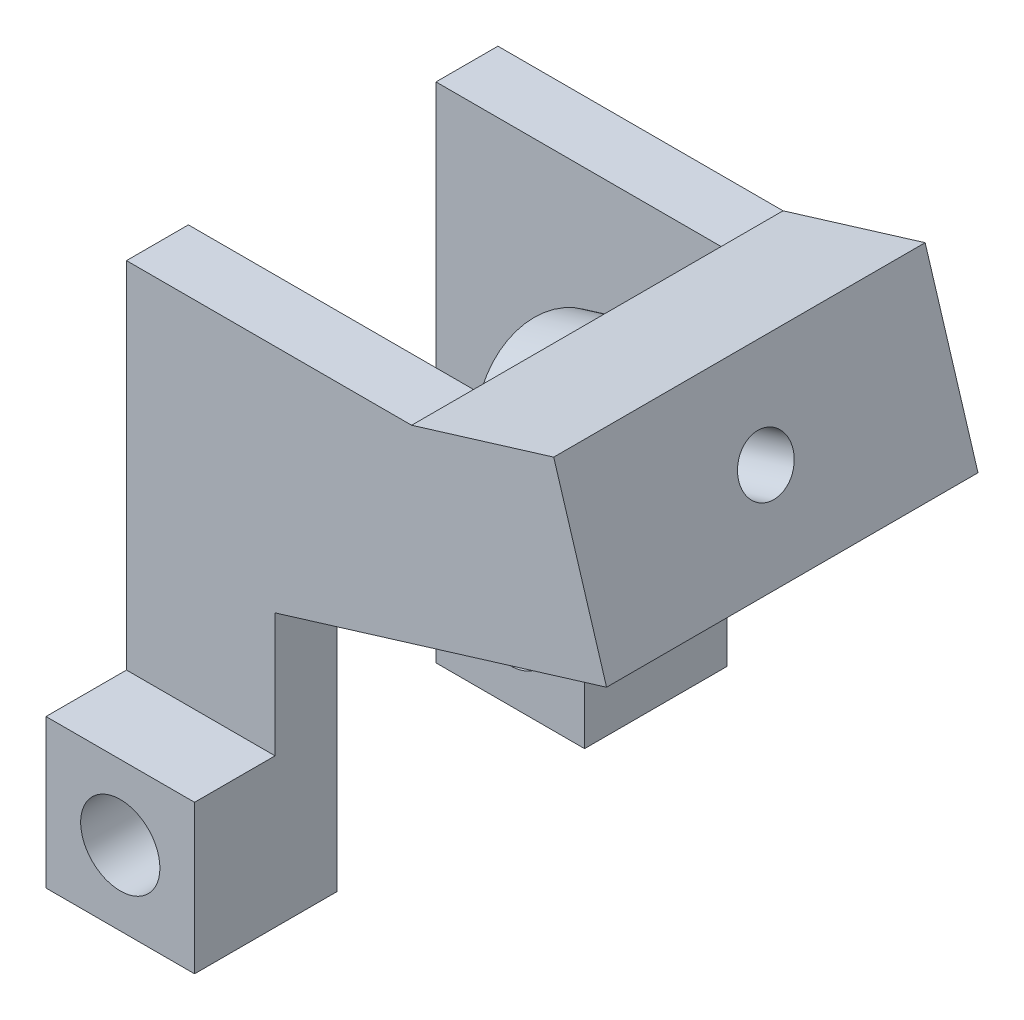
ISO-10303-21;
HEADER;
FILE_DESCRIPTION(('STEP AP214'),'2;1');
FILE_NAME('part.step','',(''),(''),'','','');
FILE_SCHEMA(('AUTOMOTIVE_DESIGN { 1 0 10303 214 1 1 1 1 }'));
ENDSEC;
DATA;
#1=APPLICATION_CONTEXT('core data for automotive mechanical design processes');
#2=APPLICATION_PROTOCOL_DEFINITION('international standard','automotive_design',2000,#1);
#3=PRODUCT_CONTEXT('',#1,'mechanical');
#4=PRODUCT('Part','Part','',(#3));
#5=PRODUCT_RELATED_PRODUCT_CATEGORY('part','',(#4));
#6=PRODUCT_DEFINITION_FORMATION('','',#4);
#7=PRODUCT_DEFINITION_CONTEXT('part definition',#1,'design');
#8=PRODUCT_DEFINITION('design','',#6,#7);
#9=PRODUCT_DEFINITION_SHAPE('','',#8);
#10=(LENGTH_UNIT() NAMED_UNIT(*) SI_UNIT(.MILLI.,.METRE.));
#11=(NAMED_UNIT(*) PLANE_ANGLE_UNIT() SI_UNIT($,.RADIAN.));
#12=(NAMED_UNIT(*) SI_UNIT($,.STERADIAN.) SOLID_ANGLE_UNIT());
#13=UNCERTAINTY_MEASURE_WITH_UNIT(LENGTH_MEASURE(1.E-05),#10,'distance_accuracy_value','');
#14=(GEOMETRIC_REPRESENTATION_CONTEXT(3) GLOBAL_UNCERTAINTY_ASSIGNED_CONTEXT((#13)) GLOBAL_UNIT_ASSIGNED_CONTEXT((#10,
#11,#12)) REPRESENTATION_CONTEXT('',''));
#15=CARTESIAN_POINT('',(0.,0.,0.));
#16=DIRECTION('',(0.,0.,1.));
#17=DIRECTION('',(1.,0.,0.));
#18=AXIS2_PLACEMENT_3D('',#15,#16,#17);
#19=CARTESIAN_POINT('',(0.,0.,9.525));
#20=DIRECTION('',(0.,0.,1.));
#21=DIRECTION('',(1.,0.,0.));
#22=AXIS2_PLACEMENT_3D('',#19,#20,#21);
#23=PLANE('',#22);
#24=DIRECTION('',(0.,-1.,0.));
#25=VECTOR('',#24,1.);
#26=CARTESIAN_POINT('',(-3.51366666666666,18.1652312458496,9.525));
#27=LINE('',#26,#25);
#28=CARTESIAN_POINT('',(-3.51366666666666,18.1652312458496,9.525));
#29=VERTEX_POINT('',#28);
#30=CARTESIAN_POINT('',(-3.51366666666666,-0.0211666666666693,9.525));
#31=VERTEX_POINT('',#30);
#32=EDGE_CURVE('E343',#29,#31,#27,.T.);
#33=ORIENTED_EDGE('',*,*,#32,.T.);
#34=DIRECTION('',(1.,0.,0.));
#35=VECTOR('',#34,1.);
#36=CARTESIAN_POINT('',(-12.1797301472788,-0.0211666666666693,9.525));
#37=LINE('',#36,#35);
#38=CARTESIAN_POINT('',(4.10633333333333,-0.0211666666666693,9.525));
#39=VERTEX_POINT('',#38);
#40=EDGE_CURVE('E236',#31,#39,#37,.T.);
#41=ORIENTED_EDGE('',*,*,#40,.T.);
#42=DIRECTION('',(0.,1.,0.));
#43=VECTOR('',#42,1.);
#44=CARTESIAN_POINT('',(4.10633333333333,-7.64116666666667,9.525));
#45=LINE('',#44,#43);
#46=CARTESIAN_POINT('',(4.10633333333333,6.32883333333333,9.525));
#47=VERTEX_POINT('',#46);
#48=EDGE_CURVE('E340',#39,#47,#45,.T.);
#49=ORIENTED_EDGE('',*,*,#48,.T.);
#50=DIRECTION('',(0.956304755963035,0.292371704722738,0.));
#51=VECTOR('',#50,1.);
#52=CARTESIAN_POINT('',(4.10633333333333,6.32883333333333,9.525));
#53=LINE('',#52,#51);
#54=CARTESIAN_POINT('',(21.1094318943561,11.5272022433036,9.525));
#55=VERTEX_POINT('',#54);
#56=EDGE_CURVE('E337',#47,#55,#53,.T.);
#57=ORIENTED_EDGE('',*,*,#56,.T.);
#58=DIRECTION('',(0.292371704722738,-0.956304755963035,0.));
#59=VECTOR('',#58,1.);
#60=CARTESIAN_POINT('',(22.5279368806983,6.8874814943936,9.525));
#61=LINE('',#60,#59);
#62=CARTESIAN_POINT('',(18.3988538198716,20.3931036358369,9.525));
#63=VERTEX_POINT('',#62);
#64=EDGE_CURVE('E301',#63,#55,#61,.T.);
#65=ORIENTED_EDGE('',*,*,#64,.F.);
#66=DIRECTION('',(-0.956304755963035,-0.292371704722738,0.));
#67=VECTOR('',#66,1.);
#68=CARTESIAN_POINT('',(18.3988538198716,20.3931036358369,9.525));
#69=LINE('',#68,#67);
#70=CARTESIAN_POINT('',(11.1118115794333,18.1652312458496,9.525));
#71=VERTEX_POINT('',#70);
#72=EDGE_CURVE('E316',#63,#71,#69,.T.);
#73=ORIENTED_EDGE('',*,*,#72,.T.);
#74=DIRECTION('',(-1.,0.,0.));
#75=VECTOR('',#74,1.);
#76=CARTESIAN_POINT('',(11.1118115794333,18.1652312458496,9.525));
#77=LINE('',#76,#75);
#78=EDGE_CURVE('E55',#71,#29,#77,.T.);
#79=ORIENTED_EDGE('',*,*,#78,.T.);
#80=EDGE_LOOP('',(#33,#41,#49,#57,#65,#73,#79));
#81=FACE_BOUND('',#80,.T.);
#82=ADVANCED_FACE('F45',(#81),#23,.T.);
#83=CARTESIAN_POINT('',(15.2408946402599,4.65960910440634,0.));
#84=DIRECTION('',(0.956304755963035,0.292371704722738,0.));
#85=DIRECTION('',(-0.292371704722738,0.956304755963035,0.));
#86=AXIS2_PLACEMENT_3D('',#83,#84,#85);
#87=PLANE('',#86);
#88=CARTESIAN_POINT('',(12.4671006166755,13.732280549583,0.));
#89=DIRECTION('',(0.956304755963035,0.292371704722738,0.));
#90=DIRECTION('',(-0.292371704722738,0.956304755963035,0.));
#91=AXIS2_PLACEMENT_3D('',#88,#89,#90);
#92=CIRCLE('',#91,4.064);
#93=CARTESIAN_POINT('',(11.2789020086823,17.6187030778168,0.));
#94=VERTEX_POINT('',#93);
#95=EDGE_CURVE('E227',#94,#94,#92,.T.);
#96=ORIENTED_EDGE('',*,*,#95,.T.);
#97=EDGE_LOOP('',(#96));
#98=FACE_BOUND('',#97,.T.);
#99=DIRECTION('',(0.292371704722738,-0.956304755963035,0.));
#100=VECTOR('',#99,1.);
#101=CARTESIAN_POINT('',(13.8223896539178,9.29932985331635,-6.35));
#102=LINE('',#101,#100);
#103=CARTESIAN_POINT('',(11.1118115794333,18.1652312458496,-6.34999999999999));
#104=VERTEX_POINT('',#103);
#105=CARTESIAN_POINT('',(13.8223896539178,9.29932985331635,-6.35));
#106=VERTEX_POINT('',#105);
#107=EDGE_CURVE('E261',#104,#106,#102,.T.);
#108=ORIENTED_EDGE('',*,*,#107,.T.);
#109=DIRECTION('',(0.,0.,-1.));
#110=VECTOR('',#109,1.);
#111=CARTESIAN_POINT('',(13.8223896539178,9.29932985331635,0.));
#112=LINE('',#111,#110);
#113=CARTESIAN_POINT('',(13.8223896539178,9.29932985331635,6.35));
#114=VERTEX_POINT('',#113);
#115=EDGE_CURVE('E296',#114,#106,#112,.T.);
#116=ORIENTED_EDGE('',*,*,#115,.F.);
#117=DIRECTION('',(-0.292371704722738,0.956304755963035,0.));
#118=VECTOR('',#117,1.);
#119=CARTESIAN_POINT('',(13.8223896539178,9.29932985331635,6.35));
#120=LINE('',#119,#118);
#121=CARTESIAN_POINT('',(11.1118115794333,18.1652312458496,6.35));
#122=VERTEX_POINT('',#121);
#123=EDGE_CURVE('E358',#114,#122,#120,.T.);
#124=ORIENTED_EDGE('',*,*,#123,.T.);
#125=DIRECTION('',(0.,0.,1.));
#126=VECTOR('',#125,1.);
#127=CARTESIAN_POINT('',(11.1118115794333,18.1652312458496,0.));
#128=LINE('',#127,#126);
#129=EDGE_CURVE('E320',#104,#122,#128,.T.);
#130=ORIENTED_EDGE('',*,*,#129,.F.);
#131=EDGE_LOOP('',(#108,#116,#124,#130));
#132=FACE_BOUND('',#131,.T.);
#133=ADVANCED_FACE('F394',(#98,#132),#87,.F.);
#134=CARTESIAN_POINT('',(-3.51366666666666,18.1652312458496,9.525));
#135=DIRECTION('',(1.,0.,0.));
#136=DIRECTION('',(0.,0.,-1.));
#137=AXIS2_PLACEMENT_3D('',#134,#135,#136);
#138=PLANE('',#137);
#139=DIRECTION('',(0.,0.,-1.));
#140=VECTOR('',#139,1.);
#141=CARTESIAN_POINT('',(-3.51366666666666,18.1652312458496,9.525));
#142=LINE('',#141,#140);
#143=CARTESIAN_POINT('',(-3.51366666666666,18.1652312458496,6.35));
#144=VERTEX_POINT('',#143);
#145=EDGE_CURVE('E49',#29,#144,#142,.T.);
#146=ORIENTED_EDGE('',*,*,#145,.T.);
#147=DIRECTION('',(0.,-1.,0.));
#148=VECTOR('',#147,1.);
#149=CARTESIAN_POINT('',(-3.51366666666666,18.1652312458496,6.35));
#150=LINE('',#149,#148);
#151=CARTESIAN_POINT('',(-3.51366666666666,-7.64116666666667,6.35));
#152=VERTEX_POINT('',#151);
#153=EDGE_CURVE('E367',#144,#152,#150,.T.);
#154=ORIENTED_EDGE('',*,*,#153,.T.);
#155=DIRECTION('',(0.,0.,-1.));
#156=VECTOR('',#155,1.);
#157=CARTESIAN_POINT('',(-3.51366666666666,-7.64116666666667,9.525));
#158=LINE('',#157,#156);
#159=CARTESIAN_POINT('',(-3.51366666666666,-7.64116666666667,13.6525));
#160=VERTEX_POINT('',#159);
#161=EDGE_CURVE('E365',#160,#152,#158,.T.);
#162=ORIENTED_EDGE('',*,*,#161,.F.);
#163=DIRECTION('',(0.,1.,0.));
#164=VECTOR('',#163,1.);
#165=CARTESIAN_POINT('',(-3.51366666666666,-0.0211666666666693,13.6525));
#166=LINE('',#165,#164);
#167=CARTESIAN_POINT('',(-3.51366666666666,-0.0211666666666693,13.6525));
#168=VERTEX_POINT('',#167);
#169=EDGE_CURVE('E223',#160,#168,#166,.T.);
#170=ORIENTED_EDGE('',*,*,#169,.T.);
#171=DIRECTION('',(0.,0.,-1.));
#172=VECTOR('',#171,1.);
#173=CARTESIAN_POINT('',(-3.51366666666666,-0.0211666666666693,13.6525));
#174=LINE('',#173,#172);
#175=EDGE_CURVE('E220',#168,#31,#174,.T.);
#176=ORIENTED_EDGE('',*,*,#175,.T.);
#177=ORIENTED_EDGE('',*,*,#32,.F.);
#178=EDGE_LOOP('',(#146,#154,#162,#170,#176,#177));
#179=FACE_BOUND('',#178,.T.);
#180=ADVANCED_FACE('F47',(#179),#138,.F.);
#181=CARTESIAN_POINT('',(-3.51366666666666,-7.64116666666667,9.525));
#182=DIRECTION('',(0.,1.,0.));
#183=DIRECTION('',(0.,0.,1.));
#184=AXIS2_PLACEMENT_3D('',#181,#182,#183);
#185=PLANE('',#184);
#186=ORIENTED_EDGE('',*,*,#161,.T.);
#187=DIRECTION('',(1.,0.,0.));
#188=VECTOR('',#187,1.);
#189=CARTESIAN_POINT('',(-3.51366666666666,-7.64116666666667,6.35));
#190=LINE('',#189,#188);
#191=CARTESIAN_POINT('',(4.10633333333333,-7.64116666666667,6.35));
#192=VERTEX_POINT('',#191);
#193=EDGE_CURVE('E362',#152,#192,#190,.T.);
#194=ORIENTED_EDGE('',*,*,#193,.T.);
#195=DIRECTION('',(0.,0.,-1.));
#196=VECTOR('',#195,1.);
#197=CARTESIAN_POINT('',(4.10633333333333,-7.64116666666667,9.525));
#198=LINE('',#197,#196);
#199=CARTESIAN_POINT('',(4.10633333333333,-7.64116666666667,13.6525));
#200=VERTEX_POINT('',#199);
#201=EDGE_CURVE('E353',#200,#192,#198,.T.);
#202=ORIENTED_EDGE('',*,*,#201,.F.);
#203=DIRECTION('',(1.,0.,0.));
#204=VECTOR('',#203,1.);
#205=CARTESIAN_POINT('',(-12.1797301472788,-7.64116666666667,13.6525));
#206=LINE('',#205,#204);
#207=EDGE_CURVE('E233',#160,#200,#206,.T.);
#208=ORIENTED_EDGE('',*,*,#207,.F.);
#209=EDGE_LOOP('',(#186,#194,#202,#208));
#210=FACE_BOUND('',#209,.T.);
#211=ADVANCED_FACE('F406',(#210),#185,.F.);
#212=CARTESIAN_POINT('',(4.10633333333333,-7.64116666666667,9.525));
#213=DIRECTION('',(-1.,0.,0.));
#214=DIRECTION('',(0.,0.,1.));
#215=AXIS2_PLACEMENT_3D('',#212,#213,#214);
#216=PLANE('',#215);
#217=ORIENTED_EDGE('',*,*,#201,.T.);
#218=DIRECTION('',(0.,1.,0.));
#219=VECTOR('',#218,1.);
#220=CARTESIAN_POINT('',(4.10633333333333,-7.64116666666667,6.35));
#221=LINE('',#220,#219);
#222=CARTESIAN_POINT('',(4.10633333333333,6.32883333333333,6.35));
#223=VERTEX_POINT('',#222);
#224=EDGE_CURVE('E348',#192,#223,#221,.T.);
#225=ORIENTED_EDGE('',*,*,#224,.T.);
#226=DIRECTION('',(0.,0.,-1.));
#227=VECTOR('',#226,1.);
#228=CARTESIAN_POINT('',(4.10633333333333,6.32883333333333,9.525));
#229=LINE('',#228,#227);
#230=EDGE_CURVE('E352',#47,#223,#229,.T.);
#231=ORIENTED_EDGE('',*,*,#230,.F.);
#232=ORIENTED_EDGE('',*,*,#48,.F.);
#233=DIRECTION('',(0.,0.,1.));
#234=VECTOR('',#233,1.);
#235=CARTESIAN_POINT('',(4.10633333333333,-0.0211666666666693,13.6525));
#236=LINE('',#235,#234);
#237=CARTESIAN_POINT('',(4.10633333333333,-0.0211666666666693,13.6525));
#238=VERTEX_POINT('',#237);
#239=EDGE_CURVE('E71',#39,#238,#236,.T.);
#240=ORIENTED_EDGE('',*,*,#239,.T.);
#241=DIRECTION('',(0.,-1.,0.));
#242=VECTOR('',#241,1.);
#243=CARTESIAN_POINT('',(4.10633333333333,-0.0211666666666693,13.6525));
#244=LINE('',#243,#242);
#245=EDGE_CURVE('E219',#238,#200,#244,.T.);
#246=ORIENTED_EDGE('',*,*,#245,.T.);
#247=EDGE_LOOP('',(#217,#225,#231,#232,#240,#246));
#248=FACE_BOUND('',#247,.T.);
#249=ADVANCED_FACE('F401',(#248),#216,.F.);
#250=CARTESIAN_POINT('',(4.10633333333333,6.32883333333333,9.525));
#251=DIRECTION('',(-0.292371704722738,0.956304755963035,0.));
#252=DIRECTION('',(-0.956304755963035,-0.292371704722738,0.));
#253=AXIS2_PLACEMENT_3D('',#250,#251,#252);
#254=PLANE('',#253);
#255=ORIENTED_EDGE('',*,*,#230,.T.);
#256=DIRECTION('',(0.956304755963035,0.292371704722738,0.));
#257=VECTOR('',#256,1.);
#258=CARTESIAN_POINT('',(4.10633333333333,6.32883333333333,6.35));
#259=LINE('',#258,#257);
#260=EDGE_CURVE('E354',#223,#114,#259,.T.);
#261=ORIENTED_EDGE('',*,*,#260,.T.);
#262=ORIENTED_EDGE('',*,*,#115,.T.);
#263=DIRECTION('',(-0.956304755963035,-0.292371704722738,0.));
#264=VECTOR('',#263,1.);
#265=CARTESIAN_POINT('',(4.10633333333334,6.32883333333333,-6.35));
#266=LINE('',#265,#264);
#267=CARTESIAN_POINT('',(4.10633333333333,6.32883333333333,-6.35));
#268=VERTEX_POINT('',#267);
#269=EDGE_CURVE('E267',#106,#268,#266,.T.);
#270=ORIENTED_EDGE('',*,*,#269,.T.);
#271=DIRECTION('',(0.,0.,-1.));
#272=VECTOR('',#271,1.);
#273=CARTESIAN_POINT('',(4.10633333333333,6.32883333333333,9.525));
#274=LINE('',#273,#272);
#275=CARTESIAN_POINT('',(4.10633333333333,6.32883333333333,-9.525));
#276=VERTEX_POINT('',#275);
#277=EDGE_CURVE('E287',#268,#276,#274,.T.);
#278=ORIENTED_EDGE('',*,*,#277,.T.);
#279=DIRECTION('',(-0.956304755963035,-0.292371704722738,0.));
#280=VECTOR('',#279,1.);
#281=CARTESIAN_POINT('',(21.1094318943561,11.5272022433036,-9.525));
#282=LINE('',#281,#280);
#283=CARTESIAN_POINT('',(21.1094318943561,11.5272022433036,-9.525));
#284=VERTEX_POINT('',#283);
#285=EDGE_CURVE('E331',#284,#276,#282,.T.);
#286=ORIENTED_EDGE('',*,*,#285,.F.);
#287=DIRECTION('',(0.,0.,-1.));
#288=VECTOR('',#287,1.);
#289=CARTESIAN_POINT('',(21.1094318943561,11.5272022433036,0.));
#290=LINE('',#289,#288);
#291=EDGE_CURVE('E306',#55,#284,#290,.T.);
#292=ORIENTED_EDGE('',*,*,#291,.F.);
#293=ORIENTED_EDGE('',*,*,#56,.F.);
#294=EDGE_LOOP('',(#255,#261,#262,#270,#278,#286,#292,#293));
#295=FACE_BOUND('',#294,.T.);
#296=ADVANCED_FACE('F397',(#295),#254,.F.);
#297=CARTESIAN_POINT('',(11.1118115794333,18.1652312458496,9.525));
#298=DIRECTION('',(0.,-1.,0.));
#299=DIRECTION('',(0.,0.,-1.));
#300=AXIS2_PLACEMENT_3D('',#297,#298,#299);
#301=PLANE('',#300);
#302=DIRECTION('',(0.,0.,-1.));
#303=VECTOR('',#302,1.);
#304=CARTESIAN_POINT('',(11.1118115794333,18.1652312458496,9.525));
#305=LINE('',#304,#303);
#306=EDGE_CURVE('E347',#71,#122,#305,.T.);
#307=ORIENTED_EDGE('',*,*,#306,.T.);
#308=DIRECTION('',(1.,0.,0.));
#309=VECTOR('',#308,1.);
#310=CARTESIAN_POINT('',(-3.51366666666666,18.1652312458496,6.35));
#311=LINE('',#310,#309);
#312=EDGE_CURVE('E11',#144,#122,#311,.T.);
#313=ORIENTED_EDGE('',*,*,#312,.F.);
#314=ORIENTED_EDGE('',*,*,#145,.F.);
#315=ORIENTED_EDGE('',*,*,#78,.F.);
#316=EDGE_LOOP('',(#307,#313,#314,#315));
#317=FACE_BOUND('',#316,.T.);
#318=ADVANCED_FACE('F384',(#317),#301,.F.);
#319=CARTESIAN_POINT('',(-3.51366666666666,18.1652312458496,6.35));
#320=DIRECTION('',(0.,0.,1.));
#321=DIRECTION('',(0.,-1.,0.));
#322=AXIS2_PLACEMENT_3D('',#319,#320,#321);
#323=PLANE('',#322);
#324=CARTESIAN_POINT('',(0.296333333333336,-3.83116666666667,6.35));
#325=DIRECTION('',(0.,0.,1.));
#326=DIRECTION('',(0.,-1.,0.));
#327=AXIS2_PLACEMENT_3D('',#324,#325,#326);
#328=CIRCLE('',#327,2.032);
#329=CARTESIAN_POINT('',(0.296333333333336,-5.86316666666667,6.35));
#330=VERTEX_POINT('',#329);
#331=EDGE_CURVE('E215',#330,#330,#328,.F.);
#332=ORIENTED_EDGE('',*,*,#331,.F.);
#333=EDGE_LOOP('',(#332));
#334=FACE_BOUND('',#333,.T.);
#335=ORIENTED_EDGE('',*,*,#193,.F.);
#336=ORIENTED_EDGE('',*,*,#153,.F.);
#337=ORIENTED_EDGE('',*,*,#312,.T.);
#338=ORIENTED_EDGE('',*,*,#123,.F.);
#339=ORIENTED_EDGE('',*,*,#260,.F.);
#340=ORIENTED_EDGE('',*,*,#224,.F.);
#341=EDGE_LOOP('',(#335,#336,#337,#338,#339,#340));
#342=FACE_BOUND('',#341,.T.);
#343=ADVANCED_FACE('F390',(#334,#342),#323,.F.);
#344=CARTESIAN_POINT('',(22.5279368806983,6.8874814943936,-9.525));
#345=DIRECTION('',(0.,0.,-1.));
#346=DIRECTION('',(-1.,0.,0.));
#347=AXIS2_PLACEMENT_3D('',#344,#345,#346);
#348=PLANE('',#347);
#349=DIRECTION('',(1.,0.,0.));
#350=VECTOR('',#349,1.);
#351=CARTESIAN_POINT('',(-12.1797301472788,-0.0211666666666693,-9.525));
#352=LINE('',#351,#350);
#353=CARTESIAN_POINT('',(-3.51366666666666,-0.0211666666666693,-9.525));
#354=VERTEX_POINT('',#353);
#355=CARTESIAN_POINT('',(4.10633333333333,-0.0211666666666693,-9.525));
#356=VERTEX_POINT('',#355);
#357=EDGE_CURVE('E63',#354,#356,#352,.T.);
#358=ORIENTED_EDGE('',*,*,#357,.F.);
#359=DIRECTION('',(0.,-1.,0.));
#360=VECTOR('',#359,1.);
#361=CARTESIAN_POINT('',(-3.51366666666666,18.1652312458496,-9.525));
#362=LINE('',#361,#360);
#363=CARTESIAN_POINT('',(-3.51366666666666,18.1652312458496,-9.525));
#364=VERTEX_POINT('',#363);
#365=EDGE_CURVE('E274',#364,#354,#362,.T.);
#366=ORIENTED_EDGE('',*,*,#365,.F.);
#367=DIRECTION('',(-1.,0.,0.));
#368=VECTOR('',#367,1.);
#369=CARTESIAN_POINT('',(11.1118115794333,18.1652312458496,-9.525));
#370=LINE('',#369,#368);
#371=CARTESIAN_POINT('',(11.1118115794333,18.1652312458496,-9.525));
#372=VERTEX_POINT('',#371);
#373=EDGE_CURVE('E280',#372,#364,#370,.T.);
#374=ORIENTED_EDGE('',*,*,#373,.F.);
#375=DIRECTION('',(-0.956304755963035,-0.292371704722738,0.));
#376=VECTOR('',#375,1.);
#377=CARTESIAN_POINT('',(18.3988538198716,20.3931036358369,-9.525));
#378=LINE('',#377,#376);
#379=CARTESIAN_POINT('',(18.3988538198716,20.3931036358369,-9.525));
#380=VERTEX_POINT('',#379);
#381=EDGE_CURVE('E327',#380,#372,#378,.T.);
#382=ORIENTED_EDGE('',*,*,#381,.F.);
#383=DIRECTION('',(0.292371704722738,-0.956304755963035,0.));
#384=VECTOR('',#383,1.);
#385=CARTESIAN_POINT('',(22.5279368806983,6.8874814943936,-9.525));
#386=LINE('',#385,#384);
#387=EDGE_CURVE('E309',#380,#284,#386,.T.);
#388=ORIENTED_EDGE('',*,*,#387,.T.);
#389=ORIENTED_EDGE('',*,*,#285,.T.);
#390=DIRECTION('',(0.,1.,0.));
#391=VECTOR('',#390,1.);
#392=CARTESIAN_POINT('',(4.10633333333333,-7.64116666666667,-9.525));
#393=LINE('',#392,#391);
#394=EDGE_CURVE('E277',#356,#276,#393,.T.);
#395=ORIENTED_EDGE('',*,*,#394,.F.);
#396=EDGE_LOOP('',(#358,#366,#374,#382,#388,#389,#395));
#397=FACE_BOUND('',#396,.T.);
#398=ADVANCED_FACE('F425',(#397),#348,.T.);
#399=CARTESIAN_POINT('',(19.7541428571139,15.9601529395703,0.));
#400=DIRECTION('',(-0.956304755963035,-0.292371704722738,0.));
#401=DIRECTION('',(0.292371704722738,-0.956304755963035,0.));
#402=AXIS2_PLACEMENT_3D('',#399,#400,#401);
#403=CYLINDRICAL_SURFACE('',#402,1.397);
#404=CARTESIAN_POINT('',(19.7541428571139,15.9601529395703,0.));
#405=DIRECTION('',(0.956304755963035,0.292371704722738,0.));
#406=DIRECTION('',(-0.292371704722738,0.956304755963035,0.));
#407=AXIS2_PLACEMENT_3D('',#404,#405,#406);
#408=CIRCLE('',#407,1.397);
#409=CARTESIAN_POINT('',(19.3456995856162,17.2961106836506,0.));
#410=VERTEX_POINT('',#409);
#411=EDGE_CURVE('E297',#410,#410,#408,.T.);
#412=ORIENTED_EDGE('',*,*,#411,.T.);
#413=EDGE_LOOP('',(#412));
#414=FACE_BOUND('',#413,.T.);
#415=CARTESIAN_POINT('',(9.06648090447097,12.6926067675889,0.));
#416=DIRECTION('',(0.956304755963035,0.292371704722738,0.));
#417=DIRECTION('',(-0.292371704722738,0.956304755963035,0.));
#418=AXIS2_PLACEMENT_3D('',#415,#416,#417);
#419=CIRCLE('',#418,1.397);
#420=CARTESIAN_POINT('',(8.65803763297331,14.0285645116693,0.));
#421=VERTEX_POINT('',#420);
#422=EDGE_CURVE('E242',#421,#421,#419,.T.);
#423=ORIENTED_EDGE('',*,*,#422,.F.);
#424=EDGE_LOOP('',(#423));
#425=FACE_BOUND('',#424,.T.);
#426=ADVANCED_FACE('F451',(#414,#425),#403,.F.);
#427=CARTESIAN_POINT('',(18.3988538198716,20.3931036358369,0.));
#428=DIRECTION('',(0.292371704722738,-0.956304755963035,0.));
#429=DIRECTION('',(0.956304755963035,0.292371704722738,0.));
#430=AXIS2_PLACEMENT_3D('',#427,#428,#429);
#431=PLANE('',#430);
#432=EDGE_CURVE('E302',#372,#104,#128,.T.);
#433=ORIENTED_EDGE('',*,*,#432,.T.);
#434=ORIENTED_EDGE('',*,*,#129,.T.);
#435=ORIENTED_EDGE('',*,*,#306,.F.);
#436=ORIENTED_EDGE('',*,*,#72,.F.);
#437=DIRECTION('',(0.,0.,1.));
#438=VECTOR('',#437,1.);
#439=CARTESIAN_POINT('',(18.3988538198716,20.3931036358369,0.));
#440=LINE('',#439,#438);
#441=EDGE_CURVE('E313',#380,#63,#440,.T.);
#442=ORIENTED_EDGE('',*,*,#441,.F.);
#443=ORIENTED_EDGE('',*,*,#381,.T.);
#444=EDGE_LOOP('',(#433,#434,#435,#436,#442,#443));
#445=FACE_BOUND('',#444,.T.);
#446=ADVANCED_FACE('F419',(#445),#431,.F.);
#447=CARTESIAN_POINT('',(22.5279368806983,6.8874814943936,0.));
#448=DIRECTION('',(0.956304755963035,0.292371704722738,0.));
#449=DIRECTION('',(-0.292371704722738,0.956304755963035,0.));
#450=AXIS2_PLACEMENT_3D('',#447,#448,#449);
#451=PLANE('',#450);
#452=ORIENTED_EDGE('',*,*,#411,.F.);
#453=EDGE_LOOP('',(#452));
#454=FACE_BOUND('',#453,.T.);
#455=ORIENTED_EDGE('',*,*,#64,.T.);
#456=ORIENTED_EDGE('',*,*,#291,.T.);
#457=ORIENTED_EDGE('',*,*,#387,.F.);
#458=ORIENTED_EDGE('',*,*,#441,.T.);
#459=EDGE_LOOP('',(#455,#456,#457,#458));
#460=FACE_BOUND('',#459,.T.);
#461=ADVANCED_FACE('F680',(#454,#460),#451,.T.);
#462=CARTESIAN_POINT('',(11.1118115794333,18.1652312458496,9.525));
#463=DIRECTION('',(0.,-1.,0.));
#464=DIRECTION('',(0.,0.,-1.));
#465=AXIS2_PLACEMENT_3D('',#462,#463,#464);
#466=PLANE('',#465);
#467=DIRECTION('',(0.,0.,-1.));
#468=VECTOR('',#467,1.);
#469=CARTESIAN_POINT('',(-3.51366666666666,18.1652312458496,9.525));
#470=LINE('',#469,#468);
#471=CARTESIAN_POINT('',(-3.51366666666666,18.1652312458496,-6.35));
#472=VERTEX_POINT('',#471);
#473=EDGE_CURVE('E284',#472,#364,#470,.T.);
#474=ORIENTED_EDGE('',*,*,#473,.F.);
#475=DIRECTION('',(1.,0.,0.));
#476=VECTOR('',#475,1.);
#477=CARTESIAN_POINT('',(-3.51366666666666,18.1652312458496,-6.35));
#478=LINE('',#477,#476);
#479=EDGE_CURVE('E258',#472,#104,#478,.T.);
#480=ORIENTED_EDGE('',*,*,#479,.T.);
#481=ORIENTED_EDGE('',*,*,#432,.F.);
#482=ORIENTED_EDGE('',*,*,#373,.T.);
#483=EDGE_LOOP('',(#474,#480,#481,#482));
#484=FACE_BOUND('',#483,.T.);
#485=ADVANCED_FACE('F424',(#484),#466,.F.);
#486=CARTESIAN_POINT('',(4.10633333333333,-7.64116666666667,9.525));
#487=DIRECTION('',(-1.,0.,0.));
#488=DIRECTION('',(0.,0.,1.));
#489=AXIS2_PLACEMENT_3D('',#486,#487,#488);
#490=PLANE('',#489);
#491=ORIENTED_EDGE('',*,*,#277,.F.);
#492=DIRECTION('',(0.,-1.,0.));
#493=VECTOR('',#492,1.);
#494=CARTESIAN_POINT('',(4.10633333333333,-7.64116666666667,-6.35));
#495=LINE('',#494,#493);
#496=CARTESIAN_POINT('',(4.10633333333333,-7.64116666666667,-6.35));
#497=VERTEX_POINT('',#496);
#498=EDGE_CURVE('E271',#268,#497,#495,.T.);
#499=ORIENTED_EDGE('',*,*,#498,.T.);
#500=DIRECTION('',(0.,0.,-1.));
#501=VECTOR('',#500,1.);
#502=CARTESIAN_POINT('',(4.10633333333333,-7.64116666666667,9.525));
#503=LINE('',#502,#501);
#504=CARTESIAN_POINT('',(4.10633333333333,-7.64116666666667,-13.6525));
#505=VERTEX_POINT('',#504);
#506=EDGE_CURVE('E192',#497,#505,#503,.T.);
#507=ORIENTED_EDGE('',*,*,#506,.T.);
#508=DIRECTION('',(0.,-1.,0.));
#509=VECTOR('',#508,1.);
#510=CARTESIAN_POINT('',(4.10633333333333,-0.0211666666666693,-13.6525));
#511=LINE('',#510,#509);
#512=CARTESIAN_POINT('',(4.10633333333333,-0.0211666666666693,-13.6525));
#513=VERTEX_POINT('',#512);
#514=EDGE_CURVE('E175',#513,#505,#511,.T.);
#515=ORIENTED_EDGE('',*,*,#514,.F.);
#516=DIRECTION('',(0.,0.,-1.));
#517=VECTOR('',#516,1.);
#518=CARTESIAN_POINT('',(4.10633333333333,-0.0211666666666693,-13.6525));
#519=LINE('',#518,#517);
#520=EDGE_CURVE('E181',#356,#513,#519,.T.);
#521=ORIENTED_EDGE('',*,*,#520,.F.);
#522=ORIENTED_EDGE('',*,*,#394,.T.);
#523=EDGE_LOOP('',(#491,#499,#507,#515,#521,#522));
#524=FACE_BOUND('',#523,.T.);
#525=ADVANCED_FACE('F189',(#524),#490,.F.);
#526=CARTESIAN_POINT('',(-3.51366666666666,-7.64116666666667,9.525));
#527=DIRECTION('',(0.,1.,0.));
#528=DIRECTION('',(0.,0.,1.));
#529=AXIS2_PLACEMENT_3D('',#526,#527,#528);
#530=PLANE('',#529);
#531=ORIENTED_EDGE('',*,*,#506,.F.);
#532=DIRECTION('',(1.,0.,0.));
#533=VECTOR('',#532,1.);
#534=CARTESIAN_POINT('',(-3.51366666666666,-7.64116666666667,-6.35));
#535=LINE('',#534,#533);
#536=CARTESIAN_POINT('',(-3.51366666666666,-7.64116666666667,-6.35));
#537=VERTEX_POINT('',#536);
#538=EDGE_CURVE('E257',#537,#497,#535,.T.);
#539=ORIENTED_EDGE('',*,*,#538,.F.);
#540=DIRECTION('',(0.,0.,-1.));
#541=VECTOR('',#540,1.);
#542=CARTESIAN_POINT('',(-3.51366666666666,-7.64116666666667,9.525));
#543=LINE('',#542,#541);
#544=CARTESIAN_POINT('',(-3.51366666666666,-7.64116666666667,-13.6525));
#545=VERTEX_POINT('',#544);
#546=EDGE_CURVE('E293',#537,#545,#543,.T.);
#547=ORIENTED_EDGE('',*,*,#546,.T.);
#548=DIRECTION('',(1.,0.,0.));
#549=VECTOR('',#548,1.);
#550=CARTESIAN_POINT('',(-12.1797301472788,-7.64116666666667,-13.6525));
#551=LINE('',#550,#549);
#552=EDGE_CURVE('E203',#545,#505,#551,.T.);
#553=ORIENTED_EDGE('',*,*,#552,.T.);
#554=EDGE_LOOP('',(#531,#539,#547,#553));
#555=FACE_BOUND('',#554,.T.);
#556=ADVANCED_FACE('F433',(#555),#530,.F.);
#557=CARTESIAN_POINT('',(-3.51366666666666,18.1652312458496,9.525));
#558=DIRECTION('',(1.,0.,0.));
#559=DIRECTION('',(0.,0.,-1.));
#560=AXIS2_PLACEMENT_3D('',#557,#558,#559);
#561=PLANE('',#560);
#562=ORIENTED_EDGE('',*,*,#546,.F.);
#563=DIRECTION('',(0.,1.,0.));
#564=VECTOR('',#563,1.);
#565=CARTESIAN_POINT('',(-3.51366666666666,18.1652312458496,-6.35));
#566=LINE('',#565,#564);
#567=EDGE_CURVE('E250',#537,#472,#566,.T.);
#568=ORIENTED_EDGE('',*,*,#567,.T.);
#569=ORIENTED_EDGE('',*,*,#473,.T.);
#570=ORIENTED_EDGE('',*,*,#365,.T.);
#571=DIRECTION('',(0.,0.,1.));
#572=VECTOR('',#571,1.);
#573=CARTESIAN_POINT('',(-3.51366666666666,-0.0211666666666693,-13.6525));
#574=LINE('',#573,#572);
#575=CARTESIAN_POINT('',(-3.51366666666666,-0.0211666666666693,-13.6525));
#576=VERTEX_POINT('',#575);
#577=EDGE_CURVE('E206',#576,#354,#574,.T.);
#578=ORIENTED_EDGE('',*,*,#577,.F.);
#579=DIRECTION('',(0.,1.,0.));
#580=VECTOR('',#579,1.);
#581=CARTESIAN_POINT('',(-3.51366666666666,-0.0211666666666693,-13.6525));
#582=LINE('',#581,#580);
#583=EDGE_CURVE('E177',#545,#576,#582,.T.);
#584=ORIENTED_EDGE('',*,*,#583,.F.);
#585=EDGE_LOOP('',(#562,#568,#569,#570,#578,#584));
#586=FACE_BOUND('',#585,.T.);
#587=ADVANCED_FACE('F428',(#586),#561,.F.);
#588=CARTESIAN_POINT('',(-3.51366666666666,18.1652312458496,-6.35));
#589=DIRECTION('',(0.,0.,-1.));
#590=DIRECTION('',(0.,1.,0.));
#591=AXIS2_PLACEMENT_3D('',#588,#589,#590);
#592=PLANE('',#591);
#593=CARTESIAN_POINT('',(0.296333333333336,-3.83116666666667,-6.35));
#594=DIRECTION('',(0.,0.,-1.));
#595=DIRECTION('',(0.,1.,0.));
#596=AXIS2_PLACEMENT_3D('',#593,#594,#595);
#597=CIRCLE('',#596,2.032);
#598=CARTESIAN_POINT('',(0.296333333333336,-1.79916666666667,-6.35));
#599=VERTEX_POINT('',#598);
#600=EDGE_CURVE('E195',#599,#599,#597,.F.);
#601=ORIENTED_EDGE('',*,*,#600,.F.);
#602=EDGE_LOOP('',(#601));
#603=FACE_BOUND('',#602,.T.);
#604=ORIENTED_EDGE('',*,*,#269,.F.);
#605=ORIENTED_EDGE('',*,*,#107,.F.);
#606=ORIENTED_EDGE('',*,*,#479,.F.);
#607=ORIENTED_EDGE('',*,*,#567,.F.);
#608=ORIENTED_EDGE('',*,*,#538,.T.);
#609=ORIENTED_EDGE('',*,*,#498,.F.);
#610=EDGE_LOOP('',(#604,#605,#606,#607,#608,#609));
#611=FACE_BOUND('',#610,.T.);
#612=ADVANCED_FACE('F431',(#603,#611),#592,.F.);
#613=CARTESIAN_POINT('',(9.06648090447097,12.6926067675889,0.));
#614=DIRECTION('',(0.956304755963035,0.292371704722738,0.));
#615=DIRECTION('',(-0.292371704722738,0.956304755963035,0.));
#616=AXIS2_PLACEMENT_3D('',#613,#614,#615);
#617=CYLINDRICAL_SURFACE('',#616,4.064);
#618=CARTESIAN_POINT('',(9.06648090447097,12.6926067675889,0.));
#619=DIRECTION('',(0.956304755963035,0.292371704722738,0.));
#620=DIRECTION('',(-0.292371704722738,0.956304755963035,0.));
#621=AXIS2_PLACEMENT_3D('',#618,#619,#620);
#622=CIRCLE('',#621,4.064);
#623=CARTESIAN_POINT('',(7.87828229647776,16.5790292958227,0.));
#624=VERTEX_POINT('',#623);
#625=EDGE_CURVE('E246',#624,#624,#622,.T.);
#626=ORIENTED_EDGE('',*,*,#625,.T.);
#627=EDGE_LOOP('',(#626));
#628=FACE_BOUND('',#627,.T.);
#629=ORIENTED_EDGE('',*,*,#95,.F.);
#630=EDGE_LOOP('',(#629));
#631=FACE_BOUND('',#630,.T.);
#632=ADVANCED_FACE('F496',(#628,#631),#617,.T.);
#633=CARTESIAN_POINT('',(11.8402749280554,3.61993532241228,0.));
#634=DIRECTION('',(0.956304755963035,0.292371704722738,0.));
#635=DIRECTION('',(-0.292371704722738,0.956304755963035,0.));
#636=AXIS2_PLACEMENT_3D('',#633,#634,#635);
#637=PLANE('',#636);
#638=ORIENTED_EDGE('',*,*,#422,.T.);
#639=EDGE_LOOP('',(#638));
#640=FACE_BOUND('',#639,.T.);
#641=ORIENTED_EDGE('',*,*,#625,.F.);
#642=EDGE_LOOP('',(#641));
#643=FACE_BOUND('',#642,.T.);
#644=ADVANCED_FACE('F500',(#640,#643),#637,.F.);
#645=CARTESIAN_POINT('',(-12.1797301472788,-0.0211666666666693,13.6525));
#646=DIRECTION('',(0.,0.,1.));
#647=DIRECTION('',(1.,0.,0.));
#648=AXIS2_PLACEMENT_3D('',#645,#646,#647);
#649=PLANE('',#648);
#650=CARTESIAN_POINT('',(0.296333333333336,-3.83116666666667,13.6525));
#651=DIRECTION('',(0.,0.,1.));
#652=DIRECTION('',(1.,0.,0.));
#653=AXIS2_PLACEMENT_3D('',#650,#651,#652);
#654=CIRCLE('',#653,2.032);
#655=CARTESIAN_POINT('',(2.32833333333334,-3.83116666666667,13.6525));
#656=VERTEX_POINT('',#655);
#657=EDGE_CURVE('E211',#656,#656,#654,.T.);
#658=ORIENTED_EDGE('',*,*,#657,.F.);
#659=EDGE_LOOP('',(#658));
#660=FACE_BOUND('',#659,.T.);
#661=ORIENTED_EDGE('',*,*,#169,.F.);
#662=ORIENTED_EDGE('',*,*,#207,.T.);
#663=ORIENTED_EDGE('',*,*,#245,.F.);
#664=DIRECTION('',(1.,0.,0.));
#665=VECTOR('',#664,1.);
#666=CARTESIAN_POINT('',(-12.1797301472788,-0.0211666666666693,13.6525));
#667=LINE('',#666,#665);
#668=EDGE_CURVE('E224',#168,#238,#667,.T.);
#669=ORIENTED_EDGE('',*,*,#668,.F.);
#670=EDGE_LOOP('',(#661,#662,#663,#669));
#671=FACE_BOUND('',#670,.T.);
#672=ADVANCED_FACE('F409',(#660,#671),#649,.T.);
#673=CARTESIAN_POINT('',(-12.1797301472788,-0.0211666666666693,13.6525));
#674=DIRECTION('',(0.,1.,0.));
#675=DIRECTION('',(0.,0.,1.));
#676=AXIS2_PLACEMENT_3D('',#673,#674,#675);
#677=PLANE('',#676);
#678=ORIENTED_EDGE('',*,*,#175,.F.);
#679=ORIENTED_EDGE('',*,*,#668,.T.);
#680=ORIENTED_EDGE('',*,*,#239,.F.);
#681=ORIENTED_EDGE('',*,*,#40,.F.);
#682=EDGE_LOOP('',(#678,#679,#680,#681));
#683=FACE_BOUND('',#682,.T.);
#684=ADVANCED_FACE('F414',(#683),#677,.T.);
#685=CARTESIAN_POINT('',(0.296333333333336,-3.83116666666667,0.602636082515739));
#686=DIRECTION('',(0.,0.,1.));
#687=DIRECTION('',(1.,0.,0.));
#688=AXIS2_PLACEMENT_3D('',#685,#686,#687);
#689=CYLINDRICAL_SURFACE('',#688,2.032);
#690=ORIENTED_EDGE('',*,*,#331,.T.);
#691=EDGE_LOOP('',(#690));
#692=FACE_BOUND('',#691,.T.);
#693=ORIENTED_EDGE('',*,*,#657,.T.);
#694=EDGE_LOOP('',(#693));
#695=FACE_BOUND('',#694,.T.);
#696=ADVANCED_FACE('F542',(#692,#695),#689,.F.);
#697=CARTESIAN_POINT('',(-12.1797301472788,-0.0211666666666693,-13.6525));
#698=DIRECTION('',(0.,-1.,0.));
#699=DIRECTION('',(0.,0.,-1.));
#700=AXIS2_PLACEMENT_3D('',#697,#698,#699);
#701=PLANE('',#700);
#702=DIRECTION('',(1.,0.,0.));
#703=VECTOR('',#702,1.);
#704=CARTESIAN_POINT('',(-12.1797301472788,-0.0211666666666693,-13.6525));
#705=LINE('',#704,#703);
#706=EDGE_CURVE('E170',#576,#513,#705,.T.);
#707=ORIENTED_EDGE('',*,*,#706,.F.);
#708=ORIENTED_EDGE('',*,*,#577,.T.);
#709=ORIENTED_EDGE('',*,*,#357,.T.);
#710=ORIENTED_EDGE('',*,*,#520,.T.);
#711=EDGE_LOOP('',(#707,#708,#709,#710));
#712=FACE_BOUND('',#711,.T.);
#713=ADVANCED_FACE('F184',(#712),#701,.F.);
#714=CARTESIAN_POINT('',(-12.1797301472788,-0.0211666666666693,-13.6525));
#715=DIRECTION('',(0.,0.,1.));
#716=DIRECTION('',(1.,0.,0.));
#717=AXIS2_PLACEMENT_3D('',#714,#715,#716);
#718=PLANE('',#717);
#719=CARTESIAN_POINT('',(0.296333333333336,-3.83116666666667,-13.6525));
#720=DIRECTION('',(0.,0.,1.));
#721=DIRECTION('',(1.,0.,0.));
#722=AXIS2_PLACEMENT_3D('',#719,#720,#721);
#723=CIRCLE('',#722,2.032);
#724=CARTESIAN_POINT('',(2.32833333333334,-3.83116666666667,-13.6525));
#725=VERTEX_POINT('',#724);
#726=EDGE_CURVE('E199',#725,#725,#723,.T.);
#727=ORIENTED_EDGE('',*,*,#726,.T.);
#728=EDGE_LOOP('',(#727));
#729=FACE_BOUND('',#728,.T.);
#730=ORIENTED_EDGE('',*,*,#552,.F.);
#731=ORIENTED_EDGE('',*,*,#583,.T.);
#732=ORIENTED_EDGE('',*,*,#706,.T.);
#733=ORIENTED_EDGE('',*,*,#514,.T.);
#734=EDGE_LOOP('',(#730,#731,#732,#733));
#735=FACE_BOUND('',#734,.T.);
#736=ADVANCED_FACE('F173',(#729,#735),#718,.F.);
#737=CARTESIAN_POINT('',(0.296333333333336,-3.83116666666667,12.0973639174843));
#738=DIRECTION('',(0.,0.,-1.));
#739=DIRECTION('',(-1.,0.,0.));
#740=AXIS2_PLACEMENT_3D('',#737,#738,#739);
#741=CYLINDRICAL_SURFACE('',#740,2.032);
#742=ORIENTED_EDGE('',*,*,#726,.F.);
#743=EDGE_LOOP('',(#742));
#744=FACE_BOUND('',#743,.T.);
#745=ORIENTED_EDGE('',*,*,#600,.T.);
#746=EDGE_LOOP('',(#745));
#747=FACE_BOUND('',#746,.T.);
#748=ADVANCED_FACE('F570',(#744,#747),#741,.F.);
#749=CLOSED_SHELL('',(#82,#133,#180,#211,#249,#296,#318,#343,#398,#426,#446,#461,#485,#525,#556,
#587,#612,#632,#644,#672,#684,#696,#713,#736,#748));
#750=MANIFOLD_SOLID_BREP('B2',#749);
#751=ADVANCED_BREP_SHAPE_REPRESENTATION('',(#18,#750),#14);
#752=SHAPE_DEFINITION_REPRESENTATION(#9,#751);
ENDSEC;
END-ISO-10303-21;
